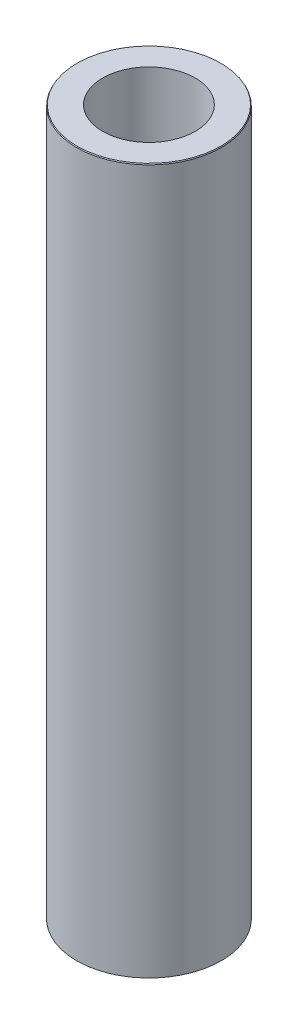
ISO-10303-21;
HEADER;
FILE_DESCRIPTION(('STEP AP214'),'2;1');
FILE_NAME('part.step','',(''),(''),'','','');
FILE_SCHEMA(('AUTOMOTIVE_DESIGN { 1 0 10303 214 1 1 1 1 }'));
ENDSEC;
DATA;
#1=APPLICATION_CONTEXT('core data for automotive mechanical design processes');
#2=APPLICATION_PROTOCOL_DEFINITION('international standard','automotive_design',2000,#1);
#3=PRODUCT_CONTEXT('',#1,'mechanical');
#4=PRODUCT('Part','Part','',(#3));
#5=PRODUCT_RELATED_PRODUCT_CATEGORY('part','',(#4));
#6=PRODUCT_DEFINITION_FORMATION('','',#4);
#7=PRODUCT_DEFINITION_CONTEXT('part definition',#1,'design');
#8=PRODUCT_DEFINITION('design','',#6,#7);
#9=PRODUCT_DEFINITION_SHAPE('','',#8);
#10=(LENGTH_UNIT() NAMED_UNIT(*) SI_UNIT(.MILLI.,.METRE.));
#11=(NAMED_UNIT(*) PLANE_ANGLE_UNIT() SI_UNIT($,.RADIAN.));
#12=(NAMED_UNIT(*) SI_UNIT($,.STERADIAN.) SOLID_ANGLE_UNIT());
#13=UNCERTAINTY_MEASURE_WITH_UNIT(LENGTH_MEASURE(1.E-05),#10,'distance_accuracy_value','');
#14=(GEOMETRIC_REPRESENTATION_CONTEXT(3) GLOBAL_UNCERTAINTY_ASSIGNED_CONTEXT((#13)) GLOBAL_UNIT_ASSIGNED_CONTEXT((#10,
#11,#12)) REPRESENTATION_CONTEXT('',''));
#15=CARTESIAN_POINT('',(0.,0.,0.));
#16=DIRECTION('',(0.,0.,1.));
#17=DIRECTION('',(1.,0.,0.));
#18=AXIS2_PLACEMENT_3D('',#15,#16,#17);
#19=CARTESIAN_POINT('',(0.,560.320718081882,0.));
#20=DIRECTION('',(0.,-1.,0.));
#21=DIRECTION('',(0.,0.,-1.));
#22=AXIS2_PLACEMENT_3D('',#19,#20,#21);
#23=CYLINDRICAL_SURFACE('',#22,57.5);
#24=CARTESIAN_POINT('',(0.,559.563271396255,0.));
#25=DIRECTION('',(0.,1.,0.));
#26=DIRECTION('',(0.,0.,1.));
#27=AXIS2_PLACEMENT_3D('',#24,#25,#26);
#28=CIRCLE('',#27,57.5);
#29=CARTESIAN_POINT('',(0.,559.563271396255,57.5));
#30=VERTEX_POINT('',#29);
#31=EDGE_CURVE('E50',#30,#30,#28,.F.);
#32=ORIENTED_EDGE('',*,*,#31,.T.);
#33=EDGE_LOOP('',(#32));
#34=FACE_BOUND('',#33,.T.);
#35=CARTESIAN_POINT('',(0.,0.437312047843141,0.));
#36=DIRECTION('',(0.,1.,0.));
#37=DIRECTION('',(0.,0.,1.));
#38=AXIS2_PLACEMENT_3D('',#35,#36,#37);
#39=CIRCLE('',#38,57.5);
#40=CARTESIAN_POINT('',(0.,0.437312047843141,57.5));
#41=VERTEX_POINT('',#40);
#42=EDGE_CURVE('E51',#41,#41,#39,.T.);
#43=ORIENTED_EDGE('',*,*,#42,.T.);
#44=EDGE_LOOP('',(#43));
#45=FACE_BOUND('',#44,.T.);
#46=ADVANCED_FACE('F39',(#34,#45),#23,.T.);
#47=CARTESIAN_POINT('',(0.,560.320718081882,0.));
#48=DIRECTION('',(0.,1.,0.));
#49=DIRECTION('',(0.,0.,1.));
#50=AXIS2_PLACEMENT_3D('',#47,#48,#49);
#51=PLANE('',#50);
#52=CARTESIAN_POINT('',(0.,560.320718081882,0.));
#53=DIRECTION('',(0.,1.,0.));
#54=DIRECTION('',(0.,0.,1.));
#55=AXIS2_PLACEMENT_3D('',#52,#53,#54);
#56=CIRCLE('',#55,57.0626879521569);
#57=CARTESIAN_POINT('',(0.,560.320718081882,57.0626879521569));
#58=VERTEX_POINT('',#57);
#59=EDGE_CURVE('E54',#58,#58,#56,.T.);
#60=ORIENTED_EDGE('',*,*,#59,.T.);
#61=EDGE_LOOP('',(#60));
#62=FACE_BOUND('',#61,.T.);
#63=CARTESIAN_POINT('',(0.,560.320718081882,0.));
#64=DIRECTION('',(0.,1.,0.));
#65=DIRECTION('',(0.,0.,1.));
#66=AXIS2_PLACEMENT_3D('',#63,#64,#65);
#67=CIRCLE('',#66,36.7470031087983);
#68=CARTESIAN_POINT('',(0.,560.320718081882,36.7470031087983));
#69=VERTEX_POINT('',#68);
#70=EDGE_CURVE('E58',#69,#69,#67,.T.);
#71=ORIENTED_EDGE('',*,*,#70,.F.);
#72=EDGE_LOOP('',(#71));
#73=FACE_BOUND('',#72,.T.);
#74=ADVANCED_FACE('F69',(#62,#73),#51,.T.);
#75=CARTESIAN_POINT('',(0.,0.,0.));
#76=DIRECTION('',(0.,1.,0.));
#77=DIRECTION('',(0.,0.,1.));
#78=AXIS2_PLACEMENT_3D('',#75,#76,#77);
#79=PLANE('',#78);
#80=CARTESIAN_POINT('',(0.,0.,0.));
#81=DIRECTION('',(0.,1.,0.));
#82=DIRECTION('',(0.,0.,1.));
#83=AXIS2_PLACEMENT_3D('',#80,#81,#82);
#84=CIRCLE('',#83,56.7425533143737);
#85=CARTESIAN_POINT('',(0.,0.,56.7425533143737));
#86=VERTEX_POINT('',#85);
#87=EDGE_CURVE('E10',#86,#86,#84,.F.);
#88=ORIENTED_EDGE('',*,*,#87,.T.);
#89=EDGE_LOOP('',(#88));
#90=FACE_BOUND('',#89,.T.);
#91=CARTESIAN_POINT('',(0.,0.,0.));
#92=DIRECTION('',(0.,1.,0.));
#93=DIRECTION('',(0.,0.,1.));
#94=AXIS2_PLACEMENT_3D('',#91,#92,#93);
#95=CIRCLE('',#94,36.7470031087983);
#96=CARTESIAN_POINT('',(0.,0.,36.7470031087983));
#97=VERTEX_POINT('',#96);
#98=EDGE_CURVE('E63',#97,#97,#95,.T.);
#99=ORIENTED_EDGE('',*,*,#98,.T.);
#100=EDGE_LOOP('',(#99));
#101=FACE_BOUND('',#100,.T.);
#102=ADVANCED_FACE('F75',(#90,#101),#79,.F.);
#103=CARTESIAN_POINT('',(0.,560.320718081882,0.));
#104=DIRECTION('',(0.,-1.,0.));
#105=DIRECTION('',(0.,0.,-1.));
#106=AXIS2_PLACEMENT_3D('',#103,#104,#105);
#107=CYLINDRICAL_SURFACE('',#106,36.7470031087983);
#108=ORIENTED_EDGE('',*,*,#70,.T.);
#109=EDGE_LOOP('',(#108));
#110=FACE_BOUND('',#109,.T.);
#111=ORIENTED_EDGE('',*,*,#98,.F.);
#112=EDGE_LOOP('',(#111));
#113=FACE_BOUND('',#112,.T.);
#114=ADVANCED_FACE('F70',(#110,#113),#107,.F.);
#115=CARTESIAN_POINT('',(0.,560.320718081882,0.));
#116=DIRECTION('',(0.,-1.,0.));
#117=DIRECTION('',(0.,0.,-1.));
#118=AXIS2_PLACEMENT_3D('',#115,#116,#117);
#119=CONICAL_SURFACE('',#118,57.0626879521569,0.523598775598265);
#120=ORIENTED_EDGE('',*,*,#31,.F.);
#121=EDGE_LOOP('',(#120));
#122=FACE_BOUND('',#121,.T.);
#123=ORIENTED_EDGE('',*,*,#59,.F.);
#124=EDGE_LOOP('',(#123));
#125=FACE_BOUND('',#124,.T.);
#126=ADVANCED_FACE('F81',(#122,#125),#119,.T.);
#127=CARTESIAN_POINT('',(0.,0.437312047843141,0.));
#128=DIRECTION('',(0.,1.,0.));
#129=DIRECTION('',(0.,0.,1.));
#130=AXIS2_PLACEMENT_3D('',#127,#128,#129);
#131=CONICAL_SURFACE('',#130,57.5,1.04719755119661);
#132=ORIENTED_EDGE('',*,*,#87,.F.);
#133=EDGE_LOOP('',(#132));
#134=FACE_BOUND('',#133,.T.);
#135=ORIENTED_EDGE('',*,*,#42,.F.);
#136=EDGE_LOOP('',(#135));
#137=FACE_BOUND('',#136,.T.);
#138=ADVANCED_FACE('F45',(#134,#137),#131,.T.);
#139=CLOSED_SHELL('',(#46,#74,#102,#114,#126,#138));
#140=MANIFOLD_SOLID_BREP('B2',#139);
#141=ADVANCED_BREP_SHAPE_REPRESENTATION('',(#18,#140),#14);
#142=SHAPE_DEFINITION_REPRESENTATION(#9,#141);
ENDSEC;
END-ISO-10303-21;
